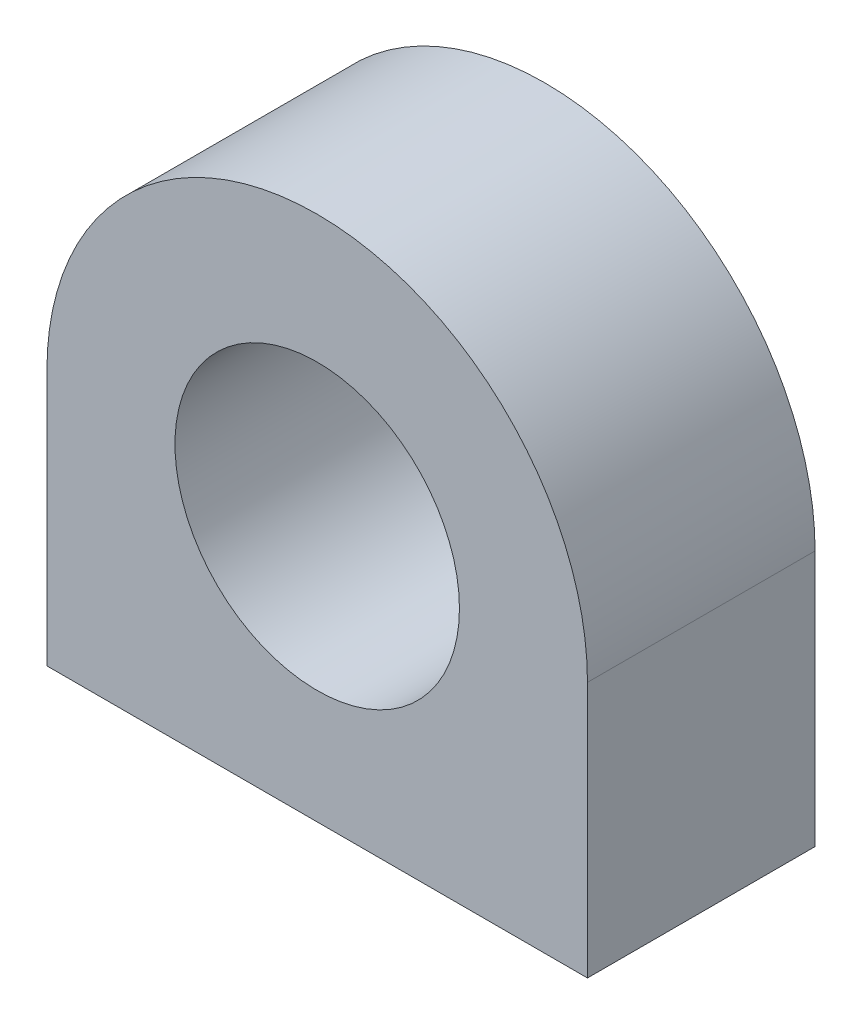
ISO-10303-21;
HEADER;
FILE_DESCRIPTION(('STEP AP214'),'2;1');
FILE_NAME('part.step','',(''),(''),'','','');
FILE_SCHEMA(('AUTOMOTIVE_DESIGN { 1 0 10303 214 1 1 1 1 }'));
ENDSEC;
DATA;
#1=APPLICATION_CONTEXT('core data for automotive mechanical design processes');
#2=APPLICATION_PROTOCOL_DEFINITION('international standard','automotive_design',2000,#1);
#3=PRODUCT_CONTEXT('',#1,'mechanical');
#4=PRODUCT('Part','Part','',(#3));
#5=PRODUCT_RELATED_PRODUCT_CATEGORY('part','',(#4));
#6=PRODUCT_DEFINITION_FORMATION('','',#4);
#7=PRODUCT_DEFINITION_CONTEXT('part definition',#1,'design');
#8=PRODUCT_DEFINITION('design','',#6,#7);
#9=PRODUCT_DEFINITION_SHAPE('','',#8);
#10=(LENGTH_UNIT() NAMED_UNIT(*) SI_UNIT(.MILLI.,.METRE.));
#11=(NAMED_UNIT(*) PLANE_ANGLE_UNIT() SI_UNIT($,.RADIAN.));
#12=(NAMED_UNIT(*) SI_UNIT($,.STERADIAN.) SOLID_ANGLE_UNIT());
#13=UNCERTAINTY_MEASURE_WITH_UNIT(LENGTH_MEASURE(1.E-05),#10,'distance_accuracy_value','');
#14=(GEOMETRIC_REPRESENTATION_CONTEXT(3) GLOBAL_UNCERTAINTY_ASSIGNED_CONTEXT((#13)) GLOBAL_UNIT_ASSIGNED_CONTEXT((#10,
#11,#12)) REPRESENTATION_CONTEXT('',''));
#15=CARTESIAN_POINT('',(0.,0.,0.));
#16=DIRECTION('',(0.,0.,1.));
#17=DIRECTION('',(1.,0.,0.));
#18=AXIS2_PLACEMENT_3D('',#15,#16,#17);
#19=CARTESIAN_POINT('',(38.,0.,32.));
#20=DIRECTION('',(-1.,0.,0.));
#21=DIRECTION('',(0.,0.,1.));
#22=AXIS2_PLACEMENT_3D('',#19,#20,#21);
#23=PLANE('',#22);
#24=DIRECTION('',(0.,1.,0.));
#25=VECTOR('',#24,1.);
#26=CARTESIAN_POINT('',(38.,0.,0.));
#27=LINE('',#26,#25);
#28=CARTESIAN_POINT('',(38.,0.,0.));
#29=VERTEX_POINT('',#28);
#30=CARTESIAN_POINT('',(38.,36.,0.));
#31=VERTEX_POINT('',#30);
#32=EDGE_CURVE('E96',#29,#31,#27,.T.);
#33=ORIENTED_EDGE('',*,*,#32,.T.);
#34=DIRECTION('',(0.,0.,-1.));
#35=VECTOR('',#34,1.);
#36=CARTESIAN_POINT('',(38.,36.,32.));
#37=LINE('',#36,#35);
#38=CARTESIAN_POINT('',(38.,36.,32.));
#39=VERTEX_POINT('',#38);
#40=EDGE_CURVE('E11',#39,#31,#37,.T.);
#41=ORIENTED_EDGE('',*,*,#40,.F.);
#42=DIRECTION('',(0.,1.,0.));
#43=VECTOR('',#42,1.);
#44=CARTESIAN_POINT('',(38.,0.,32.));
#45=LINE('',#44,#43);
#46=CARTESIAN_POINT('',(38.,0.,32.));
#47=VERTEX_POINT('',#46);
#48=EDGE_CURVE('E84',#47,#39,#45,.T.);
#49=ORIENTED_EDGE('',*,*,#48,.F.);
#50=DIRECTION('',(0.,0.,-1.));
#51=VECTOR('',#50,1.);
#52=CARTESIAN_POINT('',(38.,0.,32.));
#53=LINE('',#52,#51);
#54=EDGE_CURVE('E92',#47,#29,#53,.T.);
#55=ORIENTED_EDGE('',*,*,#54,.T.);
#56=EDGE_LOOP('',(#33,#41,#49,#55));
#57=FACE_BOUND('',#56,.T.);
#58=ADVANCED_FACE('F33',(#57),#23,.F.);
#59=CARTESIAN_POINT('',(0.,36.,32.));
#60=DIRECTION('',(0.,0.,-1.));
#61=DIRECTION('',(-1.,0.,0.));
#62=AXIS2_PLACEMENT_3D('',#59,#60,#61);
#63=CYLINDRICAL_SURFACE('',#62,38.);
#64=CARTESIAN_POINT('',(0.,36.,0.));
#65=DIRECTION('',(0.,0.,1.));
#66=DIRECTION('',(1.,0.,0.));
#67=AXIS2_PLACEMENT_3D('',#64,#65,#66);
#68=CIRCLE('',#67,38.);
#69=CARTESIAN_POINT('',(-38.,36.,0.));
#70=VERTEX_POINT('',#69);
#71=EDGE_CURVE('E88',#31,#70,#68,.T.);
#72=ORIENTED_EDGE('',*,*,#71,.T.);
#73=DIRECTION('',(0.,0.,-1.));
#74=VECTOR('',#73,1.);
#75=CARTESIAN_POINT('',(-38.,36.,32.));
#76=LINE('',#75,#74);
#77=CARTESIAN_POINT('',(-38.,36.,32.));
#78=VERTEX_POINT('',#77);
#79=EDGE_CURVE('E41',#78,#70,#76,.T.);
#80=ORIENTED_EDGE('',*,*,#79,.F.);
#81=CARTESIAN_POINT('',(0.,36.,32.));
#82=DIRECTION('',(0.,0.,1.));
#83=DIRECTION('',(1.,0.,0.));
#84=AXIS2_PLACEMENT_3D('',#81,#82,#83);
#85=CIRCLE('',#84,38.);
#86=EDGE_CURVE('E79',#39,#78,#85,.T.);
#87=ORIENTED_EDGE('',*,*,#86,.F.);
#88=ORIENTED_EDGE('',*,*,#40,.T.);
#89=EDGE_LOOP('',(#72,#80,#87,#88));
#90=FACE_BOUND('',#89,.T.);
#91=ADVANCED_FACE('F87',(#90),#63,.T.);
#92=CARTESIAN_POINT('',(-38.,0.,32.));
#93=DIRECTION('',(1.,0.,0.));
#94=DIRECTION('',(0.,0.,-1.));
#95=AXIS2_PLACEMENT_3D('',#92,#93,#94);
#96=PLANE('',#95);
#97=DIRECTION('',(0.,-1.,0.));
#98=VECTOR('',#97,1.);
#99=CARTESIAN_POINT('',(-38.,0.,0.));
#100=LINE('',#99,#98);
#101=CARTESIAN_POINT('',(-38.,0.,0.));
#102=VERTEX_POINT('',#101);
#103=EDGE_CURVE('E66',#70,#102,#100,.T.);
#104=ORIENTED_EDGE('',*,*,#103,.T.);
#105=DIRECTION('',(0.,0.,-1.));
#106=VECTOR('',#105,1.);
#107=CARTESIAN_POINT('',(-38.,0.,32.));
#108=LINE('',#107,#106);
#109=CARTESIAN_POINT('',(-38.,0.,32.));
#110=VERTEX_POINT('',#109);
#111=EDGE_CURVE('E89',#110,#102,#108,.T.);
#112=ORIENTED_EDGE('',*,*,#111,.F.);
#113=DIRECTION('',(0.,-1.,0.));
#114=VECTOR('',#113,1.);
#115=CARTESIAN_POINT('',(-38.,0.,32.));
#116=LINE('',#115,#114);
#117=EDGE_CURVE('E82',#78,#110,#116,.T.);
#118=ORIENTED_EDGE('',*,*,#117,.F.);
#119=ORIENTED_EDGE('',*,*,#79,.T.);
#120=EDGE_LOOP('',(#104,#112,#118,#119));
#121=FACE_BOUND('',#120,.T.);
#122=ADVANCED_FACE('F90',(#121),#96,.F.);
#123=CARTESIAN_POINT('',(-38.,0.,32.));
#124=DIRECTION('',(0.,1.,0.));
#125=DIRECTION('',(0.,0.,1.));
#126=AXIS2_PLACEMENT_3D('',#123,#124,#125);
#127=PLANE('',#126);
#128=DIRECTION('',(1.,0.,0.));
#129=VECTOR('',#128,1.);
#130=CARTESIAN_POINT('',(-38.,0.,0.));
#131=LINE('',#130,#129);
#132=EDGE_CURVE('E72',#102,#29,#131,.T.);
#133=ORIENTED_EDGE('',*,*,#132,.T.);
#134=ORIENTED_EDGE('',*,*,#54,.F.);
#135=DIRECTION('',(1.,0.,0.));
#136=VECTOR('',#135,1.);
#137=CARTESIAN_POINT('',(-38.,0.,32.));
#138=LINE('',#137,#136);
#139=EDGE_CURVE('E49',#110,#47,#138,.T.);
#140=ORIENTED_EDGE('',*,*,#139,.F.);
#141=ORIENTED_EDGE('',*,*,#111,.T.);
#142=EDGE_LOOP('',(#133,#134,#140,#141));
#143=FACE_BOUND('',#142,.T.);
#144=ADVANCED_FACE('F104',(#143),#127,.F.);
#145=CARTESIAN_POINT('',(0.,36.,32.));
#146=DIRECTION('',(0.,0.,1.));
#147=DIRECTION('',(1.,0.,0.));
#148=AXIS2_PLACEMENT_3D('',#145,#146,#147);
#149=PLANE('',#148);
#150=CARTESIAN_POINT('',(0.,36.,32.));
#151=DIRECTION('',(0.,0.,1.));
#152=DIRECTION('',(1.,0.,0.));
#153=AXIS2_PLACEMENT_3D('',#150,#151,#152);
#154=CIRCLE('',#153,20.);
#155=CARTESIAN_POINT('',(20.,36.,32.));
#156=VERTEX_POINT('',#155);
#157=EDGE_CURVE('E110',#156,#156,#154,.T.);
#158=ORIENTED_EDGE('',*,*,#157,.F.);
#159=EDGE_LOOP('',(#158));
#160=FACE_BOUND('',#159,.T.);
#161=ORIENTED_EDGE('',*,*,#48,.T.);
#162=ORIENTED_EDGE('',*,*,#86,.T.);
#163=ORIENTED_EDGE('',*,*,#117,.T.);
#164=ORIENTED_EDGE('',*,*,#139,.T.);
#165=EDGE_LOOP('',(#161,#162,#163,#164));
#166=FACE_BOUND('',#165,.T.);
#167=ADVANCED_FACE('F80',(#160,#166),#149,.T.);
#168=CARTESIAN_POINT('',(0.,36.,0.));
#169=DIRECTION('',(0.,0.,1.));
#170=DIRECTION('',(1.,0.,0.));
#171=AXIS2_PLACEMENT_3D('',#168,#169,#170);
#172=PLANE('',#171);
#173=CARTESIAN_POINT('',(0.,36.,0.));
#174=DIRECTION('',(0.,0.,1.));
#175=DIRECTION('',(1.,0.,0.));
#176=AXIS2_PLACEMENT_3D('',#173,#174,#175);
#177=CIRCLE('',#176,20.);
#178=CARTESIAN_POINT('',(20.,36.,0.));
#179=VERTEX_POINT('',#178);
#180=EDGE_CURVE('E99',#179,#179,#177,.T.);
#181=ORIENTED_EDGE('',*,*,#180,.T.);
#182=EDGE_LOOP('',(#181));
#183=FACE_BOUND('',#182,.T.);
#184=ORIENTED_EDGE('',*,*,#32,.F.);
#185=ORIENTED_EDGE('',*,*,#132,.F.);
#186=ORIENTED_EDGE('',*,*,#103,.F.);
#187=ORIENTED_EDGE('',*,*,#71,.F.);
#188=EDGE_LOOP('',(#184,#185,#186,#187));
#189=FACE_BOUND('',#188,.T.);
#190=ADVANCED_FACE('F107',(#183,#189),#172,.F.);
#191=CARTESIAN_POINT('',(0.,36.,0.));
#192=DIRECTION('',(0.,0.,1.));
#193=DIRECTION('',(1.,0.,0.));
#194=AXIS2_PLACEMENT_3D('',#191,#192,#193);
#195=CYLINDRICAL_SURFACE('',#194,20.);
#196=ORIENTED_EDGE('',*,*,#180,.F.);
#197=EDGE_LOOP('',(#196));
#198=FACE_BOUND('',#197,.T.);
#199=ORIENTED_EDGE('',*,*,#157,.T.);
#200=EDGE_LOOP('',(#199));
#201=FACE_BOUND('',#200,.T.);
#202=ADVANCED_FACE('F117',(#198,#201),#195,.F.);
#203=CLOSED_SHELL('',(#58,#91,#122,#144,#167,#190,#202));
#204=MANIFOLD_SOLID_BREP('B2',#203);
#205=ADVANCED_BREP_SHAPE_REPRESENTATION('',(#18,#204),#14);
#206=SHAPE_DEFINITION_REPRESENTATION(#9,#205);
ENDSEC;
END-ISO-10303-21;
